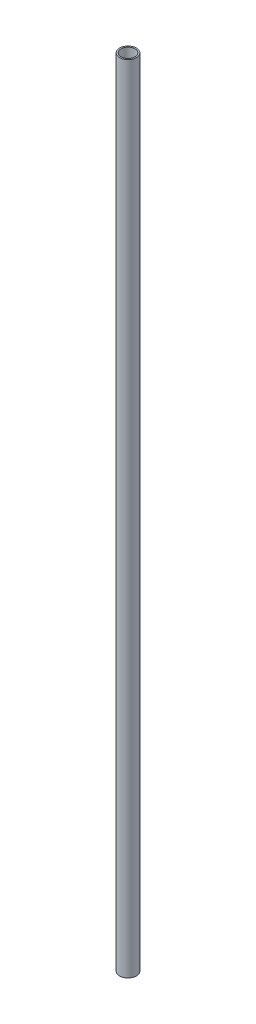
ISO-10303-21;
HEADER;
FILE_DESCRIPTION(('STEP AP214'),'2;1');
FILE_NAME('part.step','',(''),(''),'','','');
FILE_SCHEMA(('AUTOMOTIVE_DESIGN { 1 0 10303 214 1 1 1 1 }'));
ENDSEC;
DATA;
#1=APPLICATION_CONTEXT('core data for automotive mechanical design processes');
#2=APPLICATION_PROTOCOL_DEFINITION('international standard','automotive_design',2000,#1);
#3=PRODUCT_CONTEXT('',#1,'mechanical');
#4=PRODUCT('Part','Part','',(#3));
#5=PRODUCT_RELATED_PRODUCT_CATEGORY('part','',(#4));
#6=PRODUCT_DEFINITION_FORMATION('','',#4);
#7=PRODUCT_DEFINITION_CONTEXT('part definition',#1,'design');
#8=PRODUCT_DEFINITION('design','',#6,#7);
#9=PRODUCT_DEFINITION_SHAPE('','',#8);
#10=(LENGTH_UNIT() NAMED_UNIT(*) SI_UNIT(.MILLI.,.METRE.));
#11=(NAMED_UNIT(*) PLANE_ANGLE_UNIT() SI_UNIT($,.RADIAN.));
#12=(NAMED_UNIT(*) SI_UNIT($,.STERADIAN.) SOLID_ANGLE_UNIT());
#13=UNCERTAINTY_MEASURE_WITH_UNIT(LENGTH_MEASURE(1.E-05),#10,'distance_accuracy_value','');
#14=(GEOMETRIC_REPRESENTATION_CONTEXT(3) GLOBAL_UNCERTAINTY_ASSIGNED_CONTEXT((#13)) GLOBAL_UNIT_ASSIGNED_CONTEXT((#10,
#11,#12)) REPRESENTATION_CONTEXT('',''));
#15=CARTESIAN_POINT('',(0.,0.,0.));
#16=DIRECTION('',(0.,0.,1.));
#17=DIRECTION('',(1.,0.,0.));
#18=AXIS2_PLACEMENT_3D('',#15,#16,#17);
#19=CARTESIAN_POINT('',(0.,285.,0.));
#20=DIRECTION('',(0.,1.,0.));
#21=DIRECTION('',(0.,0.,1.));
#22=AXIS2_PLACEMENT_3D('',#19,#20,#21);
#23=PLANE('',#22);
#24=CARTESIAN_POINT('',(0.,285.,0.));
#25=DIRECTION('',(0.,1.,0.));
#26=DIRECTION('',(0.,0.,1.));
#27=AXIS2_PLACEMENT_3D('',#24,#25,#26);
#28=CIRCLE('',#27,3.);
#29=CARTESIAN_POINT('',(0.,285.,3.));
#30=VERTEX_POINT('',#29);
#31=EDGE_CURVE('E11',#30,#30,#28,.T.);
#32=ORIENTED_EDGE('',*,*,#31,.T.);
#33=EDGE_LOOP('',(#32));
#34=FACE_BOUND('',#33,.T.);
#35=CARTESIAN_POINT('',(0.,285.,0.));
#36=DIRECTION('',(0.,1.,0.));
#37=DIRECTION('',(0.,0.,1.));
#38=AXIS2_PLACEMENT_3D('',#35,#36,#37);
#39=CIRCLE('',#38,2.5);
#40=CARTESIAN_POINT('',(0.,285.,2.5));
#41=VERTEX_POINT('',#40);
#42=EDGE_CURVE('E56',#41,#41,#39,.T.);
#43=ORIENTED_EDGE('',*,*,#42,.F.);
#44=EDGE_LOOP('',(#43));
#45=FACE_BOUND('',#44,.T.);
#46=ADVANCED_FACE('F43',(#34,#45),#23,.T.);
#47=CARTESIAN_POINT('',(0.,0.,0.));
#48=DIRECTION('',(0.,1.,0.));
#49=DIRECTION('',(0.,0.,1.));
#50=AXIS2_PLACEMENT_3D('',#47,#48,#49);
#51=PLANE('',#50);
#52=CARTESIAN_POINT('',(0.,0.,0.));
#53=DIRECTION('',(0.,1.,0.));
#54=DIRECTION('',(0.,0.,1.));
#55=AXIS2_PLACEMENT_3D('',#52,#53,#54);
#56=CIRCLE('',#55,3.);
#57=CARTESIAN_POINT('',(0.,0.,3.));
#58=VERTEX_POINT('',#57);
#59=EDGE_CURVE('E47',#58,#58,#56,.T.);
#60=ORIENTED_EDGE('',*,*,#59,.F.);
#61=EDGE_LOOP('',(#60));
#62=FACE_BOUND('',#61,.T.);
#63=CARTESIAN_POINT('',(0.,0.,0.));
#64=DIRECTION('',(0.,1.,0.));
#65=DIRECTION('',(0.,0.,1.));
#66=AXIS2_PLACEMENT_3D('',#63,#64,#65);
#67=CIRCLE('',#66,2.5);
#68=CARTESIAN_POINT('',(0.,0.,2.5));
#69=VERTEX_POINT('',#68);
#70=EDGE_CURVE('E58',#69,#69,#67,.T.);
#71=ORIENTED_EDGE('',*,*,#70,.T.);
#72=EDGE_LOOP('',(#71));
#73=FACE_BOUND('',#72,.T.);
#74=ADVANCED_FACE('F70',(#62,#73),#51,.F.);
#75=CARTESIAN_POINT('',(0.,285.,0.));
#76=DIRECTION('',(0.,-1.,0.));
#77=DIRECTION('',(0.,0.,-1.));
#78=AXIS2_PLACEMENT_3D('',#75,#76,#77);
#79=CYLINDRICAL_SURFACE('',#78,3.);
#80=ORIENTED_EDGE('',*,*,#31,.F.);
#81=EDGE_LOOP('',(#80));
#82=FACE_BOUND('',#81,.T.);
#83=ORIENTED_EDGE('',*,*,#59,.T.);
#84=EDGE_LOOP('',(#83));
#85=FACE_BOUND('',#84,.T.);
#86=ADVANCED_FACE('F45',(#82,#85),#79,.T.);
#87=CARTESIAN_POINT('',(0.,285.,0.));
#88=DIRECTION('',(0.,-1.,0.));
#89=DIRECTION('',(0.,0.,-1.));
#90=AXIS2_PLACEMENT_3D('',#87,#88,#89);
#91=CYLINDRICAL_SURFACE('',#90,2.5);
#92=ORIENTED_EDGE('',*,*,#42,.T.);
#93=EDGE_LOOP('',(#92));
#94=FACE_BOUND('',#93,.T.);
#95=ORIENTED_EDGE('',*,*,#70,.F.);
#96=EDGE_LOOP('',(#95));
#97=FACE_BOUND('',#96,.T.);
#98=ADVANCED_FACE('F66',(#94,#97),#91,.F.);
#99=CLOSED_SHELL('',(#46,#74,#86,#98));
#100=MANIFOLD_SOLID_BREP('B2',#99);
#101=ADVANCED_BREP_SHAPE_REPRESENTATION('',(#18,#100),#14);
#102=SHAPE_DEFINITION_REPRESENTATION(#9,#101);
ENDSEC;
END-ISO-10303-21;
